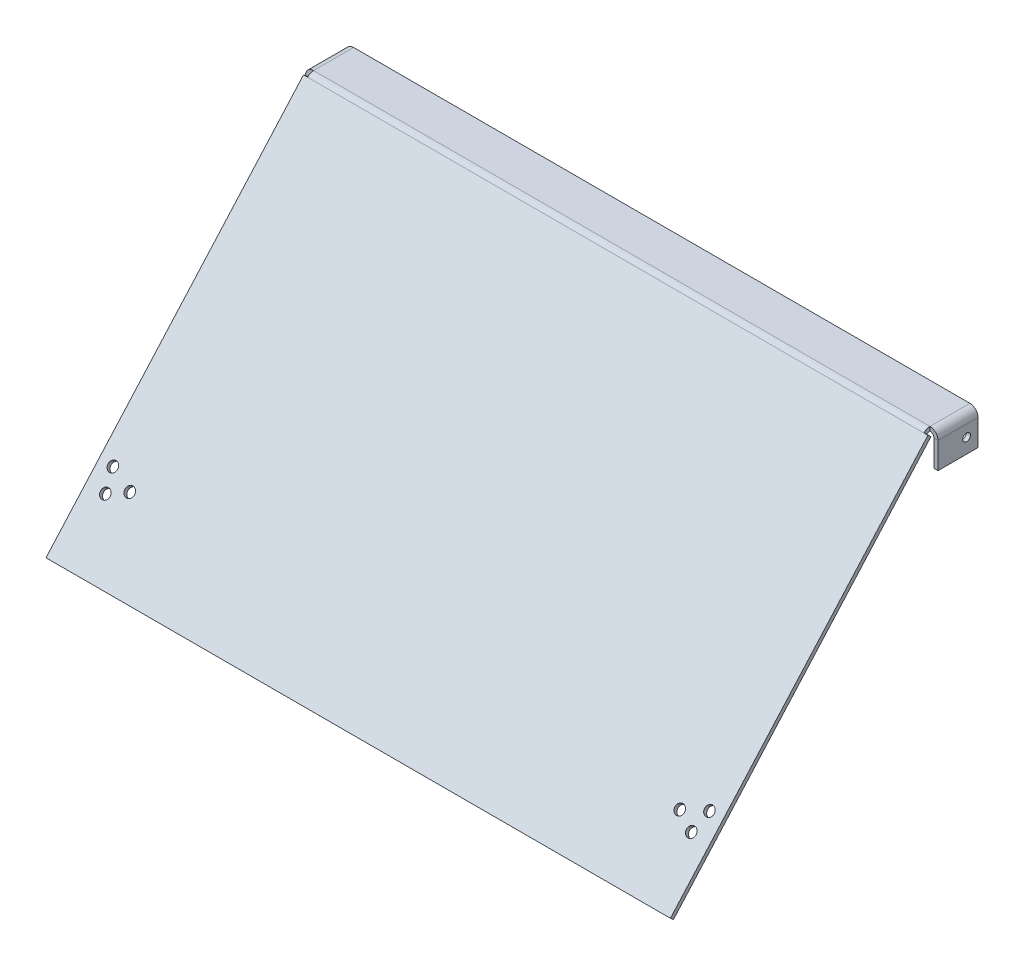
ISO-10303-21;
HEADER;
FILE_DESCRIPTION(('STEP AP214'),'2;1');
FILE_NAME('part.step','',(''),(''),'','','');
FILE_SCHEMA(('AUTOMOTIVE_DESIGN { 1 0 10303 214 1 1 1 1 }'));
ENDSEC;
DATA;
#1=APPLICATION_CONTEXT('core data for automotive mechanical design processes');
#2=APPLICATION_PROTOCOL_DEFINITION('international standard','automotive_design',2000,#1);
#3=PRODUCT_CONTEXT('',#1,'mechanical');
#4=PRODUCT('Part','Part','',(#3));
#5=PRODUCT_RELATED_PRODUCT_CATEGORY('part','',(#4));
#6=PRODUCT_DEFINITION_FORMATION('','',#4);
#7=PRODUCT_DEFINITION_CONTEXT('part definition',#1,'design');
#8=PRODUCT_DEFINITION('design','',#6,#7);
#9=PRODUCT_DEFINITION_SHAPE('','',#8);
#10=(LENGTH_UNIT() NAMED_UNIT(*) SI_UNIT(.MILLI.,.METRE.));
#11=(NAMED_UNIT(*) PLANE_ANGLE_UNIT() SI_UNIT($,.RADIAN.));
#12=(NAMED_UNIT(*) SI_UNIT($,.STERADIAN.) SOLID_ANGLE_UNIT());
#13=UNCERTAINTY_MEASURE_WITH_UNIT(LENGTH_MEASURE(1.E-05),#10,'distance_accuracy_value','');
#14=(GEOMETRIC_REPRESENTATION_CONTEXT(3) GLOBAL_UNCERTAINTY_ASSIGNED_CONTEXT((#13)) GLOBAL_UNIT_ASSIGNED_CONTEXT((#10,
#11,#12)) REPRESENTATION_CONTEXT('',''));
#15=CARTESIAN_POINT('',(0.,0.,0.));
#16=DIRECTION('',(0.,0.,1.));
#17=DIRECTION('',(1.,0.,0.));
#18=AXIS2_PLACEMENT_3D('',#15,#16,#17);
#19=CARTESIAN_POINT('',(0.,98.9907189973047,-88.0496395291812));
#20=DIRECTION('',(0.,0.747192308282182,-0.664607895261518));
#21=DIRECTION('',(0.,0.664607895261518,0.747192308282182));
#22=AXIS2_PLACEMENT_3D('',#19,#20,#21);
#23=PLANE('',#22);
#24=DIRECTION('',(0.,-0.664607895261518,-0.747192308282182));
#25=VECTOR('',#24,1.);
#26=CARTESIAN_POINT('',(202.70216,202.194058631598,27.9777837283082));
#27=LINE('',#26,#25);
#28=CARTESIAN_POINT('',(202.70216,202.194058631598,27.9777837283082));
#29=VERTEX_POINT('',#28);
#30=CARTESIAN_POINT('',(202.70216,200.428301791151,25.9926133159718));
#31=VERTEX_POINT('',#30);
#32=EDGE_CURVE('E12',#29,#31,#27,.T.);
#33=ORIENTED_EDGE('',*,*,#32,.F.);
#34=DIRECTION('',(-1.,0.,0.));
#35=VECTOR('',#34,1.);
#36=CARTESIAN_POINT('',(205.359,202.194058631598,27.9777837283082));
#37=LINE('',#36,#35);
#38=CARTESIAN_POINT('',(205.359,202.194058631598,27.9777837283082));
#39=VERTEX_POINT('',#38);
#40=EDGE_CURVE('E302',#39,#29,#37,.T.);
#41=ORIENTED_EDGE('',*,*,#40,.F.);
#42=DIRECTION('',(0.,0.664607895261518,0.747192308282182));
#43=VECTOR('',#42,1.);
#44=CARTESIAN_POINT('',(205.359,200.428301791151,25.9926133159718));
#45=LINE('',#44,#43);
#46=CARTESIAN_POINT('',(205.359,200.428301791151,25.9926133159718));
#47=VERTEX_POINT('',#46);
#48=EDGE_CURVE('E326',#47,#39,#45,.T.);
#49=ORIENTED_EDGE('',*,*,#48,.F.);
#50=DIRECTION('',(-1.,0.,0.));
#51=VECTOR('',#50,1.);
#52=CARTESIAN_POINT('',(205.359,200.428301791151,25.9926133159718));
#53=LINE('',#52,#51);
#54=EDGE_CURVE('E316',#47,#31,#53,.T.);
#55=ORIENTED_EDGE('',*,*,#54,.T.);
#56=EDGE_LOOP('',(#33,#41,#49,#55));
#57=FACE_BOUND('',#56,.T.);
#58=ADVANCED_FACE('F43',(#57),#23,.T.);
#59=CARTESIAN_POINT('',(205.359,198.662544950704,24.0074429036354));
#60=DIRECTION('',(-1.,0.,0.));
#61=DIRECTION('',(0.,0.,1.));
#62=AXIS2_PLACEMENT_3D('',#59,#60,#61);
#63=CYLINDRICAL_SURFACE('',#62,2.65684);
#64=DIRECTION('',(-1.,0.,0.));
#65=VECTOR('',#64,1.);
#66=CARTESIAN_POINT('',(205.359,201.319384950704,24.0074429036354));
#67=LINE('',#66,#65);
#68=CARTESIAN_POINT('',(202.70216,201.319384950704,24.0074429036354));
#69=VERTEX_POINT('',#68);
#70=CARTESIAN_POINT('',(-202.70216,201.319384950704,24.0074429036353));
#71=VERTEX_POINT('',#70);
#72=EDGE_CURVE('E313',#69,#71,#67,.T.);
#73=ORIENTED_EDGE('',*,*,#72,.F.);
#74=CARTESIAN_POINT('',(202.70216,198.662544950704,24.0074429036354));
#75=DIRECTION('',(1.,0.,0.));
#76=DIRECTION('',(0.,0.,-1.));
#77=AXIS2_PLACEMENT_3D('',#74,#75,#76);
#78=CIRCLE('',#77,2.65684);
#79=EDGE_CURVE('E51',#69,#31,#78,.T.);
#80=ORIENTED_EDGE('',*,*,#79,.T.);
#81=CARTESIAN_POINT('',(-202.70216,200.428301791151,25.9926133159718));
#82=VERTEX_POINT('',#81);
#83=EDGE_CURVE('E319',#31,#82,#53,.T.);
#84=ORIENTED_EDGE('',*,*,#83,.T.);
#85=CARTESIAN_POINT('',(-202.70216,198.662544950704,24.0074429036354));
#86=DIRECTION('',(-1.,0.,0.));
#87=DIRECTION('',(0.,0.,1.));
#88=AXIS2_PLACEMENT_3D('',#85,#86,#87);
#89=CIRCLE('',#88,2.65684);
#90=EDGE_CURVE('E328',#82,#71,#89,.T.);
#91=ORIENTED_EDGE('',*,*,#90,.T.);
#92=EDGE_LOOP('',(#73,#80,#84,#91));
#93=FACE_BOUND('',#92,.T.);
#94=ADVANCED_FACE('F416',(#93),#63,.F.);
#95=CARTESIAN_POINT('',(202.70216,198.662544950704,24.0074429036354));
#96=DIRECTION('',(1.,0.,0.));
#97=DIRECTION('',(0.,0.,-1.));
#98=AXIS2_PLACEMENT_3D('',#95,#96,#97);
#99=PLANE('',#98);
#100=CARTESIAN_POINT('',(202.70216,198.662544950704,24.0074429036354));
#101=DIRECTION('',(1.,0.,0.));
#102=DIRECTION('',(0.,0.,-1.));
#103=AXIS2_PLACEMENT_3D('',#100,#101,#102);
#104=CIRCLE('',#103,5.31368);
#105=CARTESIAN_POINT('',(202.70216,203.976224950704,24.0074429036353));
#106=VERTEX_POINT('',#105);
#107=EDGE_CURVE('E337',#106,#29,#104,.T.);
#108=ORIENTED_EDGE('',*,*,#107,.T.);
#109=ORIENTED_EDGE('',*,*,#32,.T.);
#110=ORIENTED_EDGE('',*,*,#79,.F.);
#111=DIRECTION('',(0.,1.,0.));
#112=VECTOR('',#111,1.);
#113=CARTESIAN_POINT('',(202.70216,201.319384950704,24.0074429036353));
#114=LINE('',#113,#112);
#115=EDGE_CURVE('E219',#69,#106,#114,.T.);
#116=ORIENTED_EDGE('',*,*,#115,.T.);
#117=EDGE_LOOP('',(#108,#109,#110,#116));
#118=FACE_BOUND('',#117,.T.);
#119=ADVANCED_FACE('F420',(#118),#99,.T.);
#120=CARTESIAN_POINT('',(205.359,201.319384950704,-2.31673739193725));
#121=DIRECTION('',(0.,-1.,0.));
#122=DIRECTION('',(0.,0.,-1.));
#123=AXIS2_PLACEMENT_3D('',#120,#121,#122);
#124=PLANE('',#123);
#125=DIRECTION('',(-1.,0.,0.));
#126=VECTOR('',#125,1.);
#127=CARTESIAN_POINT('',(205.359,201.319384950704,-2.31673739193725));
#128=LINE('',#127,#126);
#129=CARTESIAN_POINT('',(202.70216,201.319384950704,-2.31673739193725));
#130=VERTEX_POINT('',#129);
#131=CARTESIAN_POINT('',(-202.70216,201.319384950704,-2.31673739193724));
#132=VERTEX_POINT('',#131);
#133=EDGE_CURVE('E311',#130,#132,#128,.T.);
#134=ORIENTED_EDGE('',*,*,#133,.F.);
#135=DIRECTION('',(0.,0.,1.));
#136=VECTOR('',#135,1.);
#137=CARTESIAN_POINT('',(202.70216,201.319384950704,24.0074429036353));
#138=LINE('',#137,#136);
#139=EDGE_CURVE('E223',#69,#130,#138,.F.);
#140=ORIENTED_EDGE('',*,*,#139,.F.);
#141=ORIENTED_EDGE('',*,*,#72,.T.);
#142=DIRECTION('',(0.,0.,-1.));
#143=VECTOR('',#142,1.);
#144=CARTESIAN_POINT('',(-202.70216,201.319384950704,-2.31673739193724));
#145=LINE('',#144,#143);
#146=EDGE_CURVE('E275',#132,#71,#145,.F.);
#147=ORIENTED_EDGE('',*,*,#146,.F.);
#148=EDGE_LOOP('',(#134,#140,#141,#147));
#149=FACE_BOUND('',#148,.T.);
#150=ADVANCED_FACE('F426',(#149),#124,.T.);
#151=CARTESIAN_POINT('',(205.359,203.976224950704,-2.31673739193725));
#152=DIRECTION('',(0.,-1.,0.));
#153=DIRECTION('',(0.,0.,-1.));
#154=AXIS2_PLACEMENT_3D('',#151,#152,#153);
#155=PLANE('',#154);
#156=DIRECTION('',(0.,0.,1.));
#157=VECTOR('',#156,1.);
#158=CARTESIAN_POINT('',(202.70216,203.976224950704,24.0074429036353));
#159=LINE('',#158,#157);
#160=CARTESIAN_POINT('',(202.70216,203.976224950704,-2.31673739193725));
#161=VERTEX_POINT('',#160);
#162=EDGE_CURVE('E173',#106,#161,#159,.F.);
#163=ORIENTED_EDGE('',*,*,#162,.T.);
#164=DIRECTION('',(-1.,0.,0.));
#165=VECTOR('',#164,1.);
#166=CARTESIAN_POINT('',(205.359,203.976224950704,-2.31673739193725));
#167=LINE('',#166,#165);
#168=CARTESIAN_POINT('',(-202.70216,203.976224950704,-2.31673739193724));
#169=VERTEX_POINT('',#168);
#170=EDGE_CURVE('E308',#161,#169,#167,.T.);
#171=ORIENTED_EDGE('',*,*,#170,.T.);
#172=DIRECTION('',(0.,0.,-1.));
#173=VECTOR('',#172,1.);
#174=CARTESIAN_POINT('',(-202.70216,203.976224950704,-2.31673739193724));
#175=LINE('',#174,#173);
#176=CARTESIAN_POINT('',(-202.70216,203.976224950704,24.0074429036353));
#177=VERTEX_POINT('',#176);
#178=EDGE_CURVE('E262',#169,#177,#175,.F.);
#179=ORIENTED_EDGE('',*,*,#178,.T.);
#180=DIRECTION('',(-1.,0.,0.));
#181=VECTOR('',#180,1.);
#182=CARTESIAN_POINT('',(205.359,203.976224950704,24.0074429036353));
#183=LINE('',#182,#181);
#184=EDGE_CURVE('E305',#106,#177,#183,.T.);
#185=ORIENTED_EDGE('',*,*,#184,.F.);
#186=EDGE_LOOP('',(#163,#171,#179,#185));
#187=FACE_BOUND('',#186,.T.);
#188=ADVANCED_FACE('F454',(#187),#155,.F.);
#189=CARTESIAN_POINT('',(0.,98.9907189973046,-88.0496395291812));
#190=DIRECTION('',(0.,-0.747192308282182,0.664607895261518));
#191=DIRECTION('',(0.,-0.664607895261518,-0.747192308282182));
#192=AXIS2_PLACEMENT_3D('',#189,#190,#191);
#193=PLANE('',#192);
#194=DIRECTION('',(0.,0.664607895261518,0.747192308282182));
#195=VECTOR('',#194,1.);
#196=CARTESIAN_POINT('',(-202.70216,200.428301791151,25.9926133159718));
#197=LINE('',#196,#195);
#198=CARTESIAN_POINT('',(-202.70216,202.194058631598,27.9777837283082));
#199=VERTEX_POINT('',#198);
#200=EDGE_CURVE('E334',#82,#199,#197,.T.);
#201=ORIENTED_EDGE('',*,*,#200,.F.);
#202=CARTESIAN_POINT('',(-205.359,200.428301791151,25.9926133159718));
#203=VERTEX_POINT('',#202);
#204=EDGE_CURVE('E315',#82,#203,#53,.T.);
#205=ORIENTED_EDGE('',*,*,#204,.T.);
#206=DIRECTION('',(0.,-0.664607895261518,-0.747192308282182));
#207=VECTOR('',#206,1.);
#208=CARTESIAN_POINT('',(-205.359,202.194058631598,27.9777837283082));
#209=LINE('',#208,#207);
#210=CARTESIAN_POINT('',(-205.359,202.194058631598,27.9777837283082));
#211=VERTEX_POINT('',#210);
#212=EDGE_CURVE('E323',#211,#203,#209,.T.);
#213=ORIENTED_EDGE('',*,*,#212,.F.);
#214=EDGE_CURVE('E294',#199,#211,#37,.T.);
#215=ORIENTED_EDGE('',*,*,#214,.F.);
#216=EDGE_LOOP('',(#201,#205,#213,#215));
#217=FACE_BOUND('',#216,.T.);
#218=ADVANCED_FACE('F452',(#217),#193,.F.);
#219=CARTESIAN_POINT('',(205.359,203.976224950704,-2.31673739193725));
#220=DIRECTION('',(0.,0.,-1.));
#221=DIRECTION('',(-1.,0.,0.));
#222=AXIS2_PLACEMENT_3D('',#219,#220,#221);
#223=PLANE('',#222);
#224=DIRECTION('',(0.,1.,0.));
#225=VECTOR('',#224,1.);
#226=CARTESIAN_POINT('',(202.70216,201.319384950704,-2.31673739193724));
#227=LINE('',#226,#225);
#228=EDGE_CURVE('E227',#130,#161,#227,.T.);
#229=ORIENTED_EDGE('',*,*,#228,.F.);
#230=ORIENTED_EDGE('',*,*,#133,.T.);
#231=DIRECTION('',(0.,1.,0.));
#232=VECTOR('',#231,1.);
#233=CARTESIAN_POINT('',(-202.70216,201.319384950704,-2.31673739193724));
#234=LINE('',#233,#232);
#235=EDGE_CURVE('E269',#132,#169,#234,.T.);
#236=ORIENTED_EDGE('',*,*,#235,.T.);
#237=ORIENTED_EDGE('',*,*,#170,.F.);
#238=EDGE_LOOP('',(#229,#230,#236,#237));
#239=FACE_BOUND('',#238,.T.);
#240=ADVANCED_FACE('F446',(#239),#223,.T.);
#241=CARTESIAN_POINT('',(205.359,203.976224950704,24.0074429036353));
#242=DIRECTION('',(1.,0.,0.));
#243=DIRECTION('',(0.,0.,-1.));
#244=AXIS2_PLACEMENT_3D('',#241,#242,#243);
#245=PLANE('',#244);
#246=DIRECTION('',(0.,-0.747192308282181,0.664607895261519));
#247=VECTOR('',#246,1.);
#248=CARTESIAN_POINT('',(205.359,201.319384950704,25.2000182951059));
#249=LINE('',#248,#247);
#250=CARTESIAN_POINT('',(205.359,10.014243876601,195.360906934703));
#251=VERTEX_POINT('',#250);
#252=EDGE_CURVE('E291',#47,#251,#249,.T.);
#253=ORIENTED_EDGE('',*,*,#252,.F.);
#254=ORIENTED_EDGE('',*,*,#48,.T.);
#255=DIRECTION('',(0.,-0.747192308282181,0.664607895261519));
#256=VECTOR('',#255,1.);
#257=CARTESIAN_POINT('',(205.359,203.085141791151,27.1851887074423));
#258=LINE('',#257,#256);
#259=CARTESIAN_POINT('',(205.359,11.7800007170476,197.346077347039));
#260=VERTEX_POINT('',#259);
#261=EDGE_CURVE('E285',#39,#260,#258,.T.);
#262=ORIENTED_EDGE('',*,*,#261,.T.);
#263=DIRECTION('',(0.,0.664607895261532,0.747192308282169));
#264=VECTOR('',#263,1.);
#265=CARTESIAN_POINT('',(205.359,10.014243876601,195.360906934703));
#266=LINE('',#265,#264);
#267=EDGE_CURVE('E287',#251,#260,#266,.T.);
#268=ORIENTED_EDGE('',*,*,#267,.F.);
#269=EDGE_LOOP('',(#253,#254,#262,#268));
#270=FACE_BOUND('',#269,.T.);
#271=ADVANCED_FACE('F442',(#270),#245,.T.);
#272=CARTESIAN_POINT('',(205.359,203.085141791151,27.1851887074423));
#273=DIRECTION('',(0.,-0.664607895261519,-0.747192308282181));
#274=DIRECTION('',(0.,0.747192308282181,-0.664607895261519));
#275=AXIS2_PLACEMENT_3D('',#272,#273,#274);
#276=PLANE('',#275);
#277=CARTESIAN_POINT('',(180.893128060702,46.1870021263397,166.74195504088));
#278=DIRECTION('',(0.,-0.664607895261519,-0.747192308282181));
#279=DIRECTION('',(0.,-0.747192308282181,0.664607895261519));
#280=AXIS2_PLACEMENT_3D('',#277,#278,#279);
#281=CIRCLE('',#280,3.17500000003915);
#282=CARTESIAN_POINT('',(180.893128060702,43.8146665475145,168.852085108361));
#283=VERTEX_POINT('',#282);
#284=EDGE_CURVE('E359',#283,#283,#281,.T.);
#285=ORIENTED_EDGE('',*,*,#284,.T.);
#286=EDGE_LOOP('',(#285));
#287=FACE_BOUND('',#286,.T.);
#288=CARTESIAN_POINT('',(196.215000000167,50.9316732839315,162.521694905969));
#289=DIRECTION('',(0.,-0.664607895261519,-0.747192308282181));
#290=DIRECTION('',(0.,-0.747192308282181,0.664607895261519));
#291=AXIS2_PLACEMENT_3D('',#288,#289,#290);
#292=CIRCLE('',#291,3.17500000003912);
#293=CARTESIAN_POINT('',(196.215000000167,48.5593377051064,164.63182497345));
#294=VERTEX_POINT('',#293);
#295=EDGE_CURVE('E714',#294,#294,#292,.T.);
#296=ORIENTED_EDGE('',*,*,#295,.T.);
#297=EDGE_LOOP('',(#296));
#298=FACE_BOUND('',#297,.T.);
#299=CARTESIAN_POINT('',(192.704128060702,41.4423309687478,170.96221517579));
#300=DIRECTION('',(0.,-0.664607895261519,-0.747192308282181));
#301=DIRECTION('',(0.,-0.747192308282181,0.664607895261519));
#302=AXIS2_PLACEMENT_3D('',#299,#300,#301);
#303=CIRCLE('',#302,3.17500000003913);
#304=CARTESIAN_POINT('',(192.704128060702,39.0699953899227,173.072345243272));
#305=VERTEX_POINT('',#304);
#306=EDGE_CURVE('E711',#305,#305,#303,.T.);
#307=ORIENTED_EDGE('',*,*,#306,.T.);
#308=EDGE_LOOP('',(#307));
#309=FACE_BOUND('',#308,.T.);
#310=CARTESIAN_POINT('',(-180.893128060702,46.1870021263397,166.74195504088));
#311=DIRECTION('',(0.,0.664607895261519,0.747192308282181));
#312=DIRECTION('',(0.,-0.747192308282181,0.664607895261519));
#313=AXIS2_PLACEMENT_3D('',#310,#311,#312);
#314=CIRCLE('',#313,3.17500000003915);
#315=CARTESIAN_POINT('',(-180.893128060702,43.8146665475145,168.852085108361));
#316=VERTEX_POINT('',#315);
#317=EDGE_CURVE('E349',#316,#316,#314,.T.);
#318=ORIENTED_EDGE('',*,*,#317,.F.);
#319=EDGE_LOOP('',(#318));
#320=FACE_BOUND('',#319,.T.);
#321=CARTESIAN_POINT('',(-196.215000000167,50.9316732839315,162.521694905969));
#322=DIRECTION('',(0.,0.664607895261519,0.747192308282181));
#323=DIRECTION('',(0.,-0.747192308282181,0.664607895261519));
#324=AXIS2_PLACEMENT_3D('',#321,#322,#323);
#325=CIRCLE('',#324,3.17500000003912);
#326=CARTESIAN_POINT('',(-196.215000000167,48.5593377051064,164.63182497345));
#327=VERTEX_POINT('',#326);
#328=EDGE_CURVE('E364',#327,#327,#325,.T.);
#329=ORIENTED_EDGE('',*,*,#328,.F.);
#330=EDGE_LOOP('',(#329));
#331=FACE_BOUND('',#330,.T.);
#332=CARTESIAN_POINT('',(-192.704128060702,41.4423309687478,170.96221517579));
#333=DIRECTION('',(0.,0.664607895261519,0.747192308282181));
#334=DIRECTION('',(0.,-0.747192308282181,0.664607895261519));
#335=AXIS2_PLACEMENT_3D('',#332,#333,#334);
#336=CIRCLE('',#335,3.17500000003913);
#337=CARTESIAN_POINT('',(-192.704128060702,39.0699953899227,173.072345243272));
#338=VERTEX_POINT('',#337);
#339=EDGE_CURVE('E368',#338,#338,#336,.T.);
#340=ORIENTED_EDGE('',*,*,#339,.F.);
#341=EDGE_LOOP('',(#340));
#342=FACE_BOUND('',#341,.T.);
#343=DIRECTION('',(0.,-0.747192308282181,0.664607895261519));
#344=VECTOR('',#343,1.);
#345=CARTESIAN_POINT('',(-205.359,203.085141791151,27.1851887074423));
#346=LINE('',#345,#344);
#347=CARTESIAN_POINT('',(-205.359,11.7800007170476,197.346077347039));
#348=VERTEX_POINT('',#347);
#349=EDGE_CURVE('E283',#211,#348,#346,.T.);
#350=ORIENTED_EDGE('',*,*,#349,.T.);
#351=DIRECTION('',(-1.,0.,0.));
#352=VECTOR('',#351,1.);
#353=CARTESIAN_POINT('',(205.359,11.7800007170476,197.346077347039));
#354=LINE('',#353,#352);
#355=EDGE_CURVE('E321',#260,#348,#354,.T.);
#356=ORIENTED_EDGE('',*,*,#355,.F.);
#357=ORIENTED_EDGE('',*,*,#261,.F.);
#358=ORIENTED_EDGE('',*,*,#40,.T.);
#359=EDGE_CURVE('E306',#29,#199,#37,.T.);
#360=ORIENTED_EDGE('',*,*,#359,.T.);
#361=ORIENTED_EDGE('',*,*,#214,.T.);
#362=EDGE_LOOP('',(#350,#356,#357,#358,#360,#361));
#363=FACE_BOUND('',#362,.T.);
#364=ADVANCED_FACE('F438',(#287,#298,#309,#320,#331,#342,#363),#276,.F.);
#365=CARTESIAN_POINT('',(205.359,10.014243876601,195.360906934703));
#366=DIRECTION('',(0.,-0.747192308282169,0.664607895261532));
#367=DIRECTION('',(0.,-0.664607895261532,-0.747192308282169));
#368=AXIS2_PLACEMENT_3D('',#365,#366,#367);
#369=PLANE('',#368);
#370=DIRECTION('',(0.,0.664607895261532,0.747192308282169));
#371=VECTOR('',#370,1.);
#372=CARTESIAN_POINT('',(-205.359,10.014243876601,195.360906934703));
#373=LINE('',#372,#371);
#374=CARTESIAN_POINT('',(-205.359,10.014243876601,195.360906934703));
#375=VERTEX_POINT('',#374);
#376=EDGE_CURVE('E297',#375,#348,#373,.T.);
#377=ORIENTED_EDGE('',*,*,#376,.F.);
#378=DIRECTION('',(-1.,0.,0.));
#379=VECTOR('',#378,1.);
#380=CARTESIAN_POINT('',(205.359,10.014243876601,195.360906934703));
#381=LINE('',#380,#379);
#382=EDGE_CURVE('E318',#251,#375,#381,.T.);
#383=ORIENTED_EDGE('',*,*,#382,.F.);
#384=ORIENTED_EDGE('',*,*,#267,.T.);
#385=ORIENTED_EDGE('',*,*,#355,.T.);
#386=EDGE_LOOP('',(#377,#383,#384,#385));
#387=FACE_BOUND('',#386,.T.);
#388=ADVANCED_FACE('F435',(#387),#369,.T.);
#389=CARTESIAN_POINT('',(205.359,201.319384950704,25.2000182951059));
#390=DIRECTION('',(0.,-0.664607895261519,-0.747192308282181));
#391=DIRECTION('',(0.,0.747192308282181,-0.664607895261519));
#392=AXIS2_PLACEMENT_3D('',#389,#390,#391);
#393=PLANE('',#392);
#394=CARTESIAN_POINT('',(180.893128060702,44.4212452858931,164.756784628543));
#395=DIRECTION('',(0.,-0.664607895261519,-0.747192308282181));
#396=DIRECTION('',(0.,0.747192308282181,-0.664607895261519));
#397=AXIS2_PLACEMENT_3D('',#394,#395,#396);
#398=CIRCLE('',#397,3.17500000003915);
#399=CARTESIAN_POINT('',(180.893128060702,46.7935808647183,162.646654561062));
#400=VERTEX_POINT('',#399);
#401=EDGE_CURVE('E46',#400,#400,#398,.F.);
#402=ORIENTED_EDGE('',*,*,#401,.T.);
#403=EDGE_LOOP('',(#402));
#404=FACE_BOUND('',#403,.T.);
#405=CARTESIAN_POINT('',(196.215000000167,49.1659164434849,160.536524493633));
#406=DIRECTION('',(0.,-0.664607895261519,-0.747192308282181));
#407=DIRECTION('',(0.,0.747192308282181,-0.664607895261519));
#408=AXIS2_PLACEMENT_3D('',#405,#406,#407);
#409=CIRCLE('',#408,3.17500000003912);
#410=CARTESIAN_POINT('',(196.215000000167,51.5382520223101,158.426394426151));
#411=VERTEX_POINT('',#410);
#412=EDGE_CURVE('E358',#411,#411,#409,.F.);
#413=ORIENTED_EDGE('',*,*,#412,.T.);
#414=EDGE_LOOP('',(#413));
#415=FACE_BOUND('',#414,.T.);
#416=CARTESIAN_POINT('',(192.704128060702,39.6765741283012,168.977044763454));
#417=DIRECTION('',(0.,-0.664607895261519,-0.747192308282181));
#418=DIRECTION('',(0.,0.747192308282181,-0.664607895261519));
#419=AXIS2_PLACEMENT_3D('',#416,#417,#418);
#420=CIRCLE('',#419,3.17500000003913);
#421=CARTESIAN_POINT('',(192.704128060702,42.0489097071264,166.866914695973));
#422=VERTEX_POINT('',#421);
#423=EDGE_CURVE('E356',#422,#422,#420,.F.);
#424=ORIENTED_EDGE('',*,*,#423,.T.);
#425=EDGE_LOOP('',(#424));
#426=FACE_BOUND('',#425,.T.);
#427=CARTESIAN_POINT('',(-180.893128060702,44.4212452858931,164.756784628543));
#428=DIRECTION('',(0.,-0.664607895261519,-0.747192308282181));
#429=DIRECTION('',(0.,0.747192308282181,-0.664607895261519));
#430=AXIS2_PLACEMENT_3D('',#427,#428,#429);
#431=CIRCLE('',#430,3.17500000003915);
#432=CARTESIAN_POINT('',(-180.893128060702,46.7935808647183,162.646654561062));
#433=VERTEX_POINT('',#432);
#434=EDGE_CURVE('E352',#433,#433,#431,.T.);
#435=ORIENTED_EDGE('',*,*,#434,.F.);
#436=EDGE_LOOP('',(#435));
#437=FACE_BOUND('',#436,.T.);
#438=CARTESIAN_POINT('',(-196.215000000167,49.1659164434849,160.536524493633));
#439=DIRECTION('',(0.,-0.664607895261519,-0.747192308282181));
#440=DIRECTION('',(0.,0.747192308282181,-0.664607895261519));
#441=AXIS2_PLACEMENT_3D('',#438,#439,#440);
#442=CIRCLE('',#441,3.17500000003912);
#443=CARTESIAN_POINT('',(-196.215000000167,51.5382520223101,158.426394426151));
#444=VERTEX_POINT('',#443);
#445=EDGE_CURVE('E348',#444,#444,#442,.T.);
#446=ORIENTED_EDGE('',*,*,#445,.F.);
#447=EDGE_LOOP('',(#446));
#448=FACE_BOUND('',#447,.T.);
#449=CARTESIAN_POINT('',(-192.704128060702,39.6765741283012,168.977044763454));
#450=DIRECTION('',(0.,-0.664607895261519,-0.747192308282181));
#451=DIRECTION('',(0.,0.747192308282181,-0.664607895261519));
#452=AXIS2_PLACEMENT_3D('',#449,#450,#451);
#453=CIRCLE('',#452,3.17500000003913);
#454=CARTESIAN_POINT('',(-192.704128060702,42.0489097071264,166.866914695973));
#455=VERTEX_POINT('',#454);
#456=EDGE_CURVE('E345',#455,#455,#453,.T.);
#457=ORIENTED_EDGE('',*,*,#456,.F.);
#458=EDGE_LOOP('',(#457));
#459=FACE_BOUND('',#458,.T.);
#460=DIRECTION('',(0.,-0.747192308282181,0.664607895261519));
#461=VECTOR('',#460,1.);
#462=CARTESIAN_POINT('',(-205.359,201.319384950704,25.2000182951059));
#463=LINE('',#462,#461);
#464=EDGE_CURVE('E288',#203,#375,#463,.T.);
#465=ORIENTED_EDGE('',*,*,#464,.F.);
#466=ORIENTED_EDGE('',*,*,#204,.F.);
#467=ORIENTED_EDGE('',*,*,#83,.F.);
#468=ORIENTED_EDGE('',*,*,#54,.F.);
#469=ORIENTED_EDGE('',*,*,#252,.T.);
#470=ORIENTED_EDGE('',*,*,#382,.T.);
#471=EDGE_LOOP('',(#465,#466,#467,#468,#469,#470));
#472=FACE_BOUND('',#471,.T.);
#473=ADVANCED_FACE('F431',(#404,#415,#426,#437,#448,#459,#472),#393,.T.);
#474=CARTESIAN_POINT('',(-202.70216,198.662544950704,24.0074429036354));
#475=DIRECTION('',(-1.,0.,0.));
#476=DIRECTION('',(0.,0.,1.));
#477=AXIS2_PLACEMENT_3D('',#474,#475,#476);
#478=PLANE('',#477);
#479=ORIENTED_EDGE('',*,*,#90,.F.);
#480=ORIENTED_EDGE('',*,*,#200,.T.);
#481=CARTESIAN_POINT('',(-202.70216,198.662544950704,24.0074429036354));
#482=DIRECTION('',(-1.,0.,0.));
#483=DIRECTION('',(0.,0.,1.));
#484=AXIS2_PLACEMENT_3D('',#481,#482,#483);
#485=CIRCLE('',#484,5.31368);
#486=EDGE_CURVE('E331',#199,#177,#485,.T.);
#487=ORIENTED_EDGE('',*,*,#486,.T.);
#488=DIRECTION('',(0.,1.,0.));
#489=VECTOR('',#488,1.);
#490=CARTESIAN_POINT('',(-202.70216,201.319384950704,24.0074429036353));
#491=LINE('',#490,#489);
#492=EDGE_CURVE('E280',#71,#177,#491,.T.);
#493=ORIENTED_EDGE('',*,*,#492,.F.);
#494=EDGE_LOOP('',(#479,#480,#487,#493));
#495=FACE_BOUND('',#494,.T.);
#496=ADVANCED_FACE('F434',(#495),#478,.T.);
#497=CARTESIAN_POINT('',(205.359,198.662544950704,24.0074429036354));
#498=DIRECTION('',(-1.,0.,0.));
#499=DIRECTION('',(0.,0.,1.));
#500=AXIS2_PLACEMENT_3D('',#497,#498,#499);
#501=CYLINDRICAL_SURFACE('',#500,5.31368);
#502=ORIENTED_EDGE('',*,*,#107,.F.);
#503=ORIENTED_EDGE('',*,*,#184,.T.);
#504=ORIENTED_EDGE('',*,*,#486,.F.);
#505=ORIENTED_EDGE('',*,*,#359,.F.);
#506=EDGE_LOOP('',(#502,#503,#504,#505));
#507=FACE_BOUND('',#506,.T.);
#508=ADVANCED_FACE('F450',(#507),#501,.T.);
#509=CARTESIAN_POINT('',(-205.359,198.662544950704,24.0074429036354));
#510=DIRECTION('',(-1.,0.,0.));
#511=DIRECTION('',(0.,0.,1.));
#512=AXIS2_PLACEMENT_3D('',#509,#510,#511);
#513=PLANE('',#512);
#514=ORIENTED_EDGE('',*,*,#349,.F.);
#515=ORIENTED_EDGE('',*,*,#212,.T.);
#516=ORIENTED_EDGE('',*,*,#464,.T.);
#517=ORIENTED_EDGE('',*,*,#376,.T.);
#518=EDGE_LOOP('',(#514,#515,#516,#517));
#519=FACE_BOUND('',#518,.T.);
#520=ADVANCED_FACE('F536',(#519),#513,.T.);
#521=CARTESIAN_POINT('',(-202.70216,198.662544950704,24.0074429036353));
#522=DIRECTION('',(0.,0.,1.));
#523=DIRECTION('',(1.,0.,0.));
#524=AXIS2_PLACEMENT_3D('',#521,#522,#523);
#525=PLANE('',#524);
#526=DIRECTION('',(-1.,0.,0.));
#527=VECTOR('',#526,1.);
#528=CARTESIAN_POINT('',(-205.359,198.662544950704,24.0074429036354));
#529=LINE('',#528,#527);
#530=CARTESIAN_POINT('',(-205.359,198.662544950704,24.0074429036353));
#531=VERTEX_POINT('',#530);
#532=CARTESIAN_POINT('',(-208.01584,198.662544950704,24.0074429036353));
#533=VERTEX_POINT('',#532);
#534=EDGE_CURVE('E230',#531,#533,#529,.T.);
#535=ORIENTED_EDGE('',*,*,#534,.F.);
#536=CARTESIAN_POINT('',(-202.70216,198.662544950704,24.0074429036353));
#537=DIRECTION('',(0.,0.,-1.));
#538=DIRECTION('',(-1.,0.,0.));
#539=AXIS2_PLACEMENT_3D('',#536,#537,#538);
#540=CIRCLE('',#539,2.65683999999999);
#541=EDGE_CURVE('E272',#71,#531,#540,.F.);
#542=ORIENTED_EDGE('',*,*,#541,.F.);
#543=ORIENTED_EDGE('',*,*,#492,.T.);
#544=CARTESIAN_POINT('',(-202.70216,198.662544950704,24.0074429036353));
#545=DIRECTION('',(0.,0.,-1.));
#546=DIRECTION('',(-1.,0.,0.));
#547=AXIS2_PLACEMENT_3D('',#544,#545,#546);
#548=CIRCLE('',#547,5.31367999999999);
#549=EDGE_CURVE('E265',#177,#533,#548,.F.);
#550=ORIENTED_EDGE('',*,*,#549,.T.);
#551=EDGE_LOOP('',(#535,#542,#543,#550));
#552=FACE_BOUND('',#551,.T.);
#553=ADVANCED_FACE('F507',(#552),#525,.T.);
#554=CARTESIAN_POINT('',(-202.70216,198.662544950704,-2.31673739193724));
#555=DIRECTION('',(0.,0.,1.));
#556=DIRECTION('',(1.,0.,0.));
#557=AXIS2_PLACEMENT_3D('',#554,#555,#556);
#558=PLANE('',#557);
#559=CARTESIAN_POINT('',(-202.70216,198.662544950704,-2.31673739193724));
#560=DIRECTION('',(0.,0.,-1.));
#561=DIRECTION('',(-1.,0.,0.));
#562=AXIS2_PLACEMENT_3D('',#559,#560,#561);
#563=CIRCLE('',#562,2.65683999999999);
#564=CARTESIAN_POINT('',(-205.359,198.662544950704,-2.31673739193724));
#565=VERTEX_POINT('',#564);
#566=EDGE_CURVE('E261',#565,#132,#563,.T.);
#567=ORIENTED_EDGE('',*,*,#566,.F.);
#568=DIRECTION('',(-1.,0.,0.));
#569=VECTOR('',#568,1.);
#570=CARTESIAN_POINT('',(-205.359,198.662544950704,-2.31673739193724));
#571=LINE('',#570,#569);
#572=CARTESIAN_POINT('',(-208.01584,198.662544950704,-2.31673739193724));
#573=VERTEX_POINT('',#572);
#574=EDGE_CURVE('E234',#565,#573,#571,.T.);
#575=ORIENTED_EDGE('',*,*,#574,.T.);
#576=CARTESIAN_POINT('',(-202.70216,198.662544950704,-2.31673739193724));
#577=DIRECTION('',(0.,0.,-1.));
#578=DIRECTION('',(-1.,0.,0.));
#579=AXIS2_PLACEMENT_3D('',#576,#577,#578);
#580=CIRCLE('',#579,5.31367999999999);
#581=EDGE_CURVE('E266',#573,#169,#580,.T.);
#582=ORIENTED_EDGE('',*,*,#581,.T.);
#583=ORIENTED_EDGE('',*,*,#235,.F.);
#584=EDGE_LOOP('',(#567,#575,#582,#583));
#585=FACE_BOUND('',#584,.T.);
#586=ADVANCED_FACE('F486',(#585),#558,.F.);
#587=CARTESIAN_POINT('',(-202.70216,198.662544950704,-2.31673739193724));
#588=DIRECTION('',(0.,0.,-1.));
#589=DIRECTION('',(-1.,0.,0.));
#590=AXIS2_PLACEMENT_3D('',#587,#588,#589);
#591=CYLINDRICAL_SURFACE('',#590,5.31367999999999);
#592=ORIENTED_EDGE('',*,*,#178,.F.);
#593=ORIENTED_EDGE('',*,*,#581,.F.);
#594=DIRECTION('',(0.,0.,1.));
#595=VECTOR('',#594,1.);
#596=CARTESIAN_POINT('',(-208.01584,198.662544950704,0.));
#597=LINE('',#596,#595);
#598=EDGE_CURVE('E237',#573,#533,#597,.T.);
#599=ORIENTED_EDGE('',*,*,#598,.T.);
#600=ORIENTED_EDGE('',*,*,#549,.F.);
#601=EDGE_LOOP('',(#592,#593,#599,#600));
#602=FACE_BOUND('',#601,.T.);
#603=ADVANCED_FACE('F483',(#602),#591,.T.);
#604=CARTESIAN_POINT('',(-202.70216,198.662544950704,-2.31673739193724));
#605=DIRECTION('',(0.,0.,-1.));
#606=DIRECTION('',(-1.,0.,0.));
#607=AXIS2_PLACEMENT_3D('',#604,#605,#606);
#608=CYLINDRICAL_SURFACE('',#607,2.65683999999999);
#609=ORIENTED_EDGE('',*,*,#146,.T.);
#610=ORIENTED_EDGE('',*,*,#541,.T.);
#611=DIRECTION('',(0.,0.,-1.));
#612=VECTOR('',#611,1.);
#613=CARTESIAN_POINT('',(-205.359,198.662544950704,24.0074429036354));
#614=LINE('',#613,#612);
#615=EDGE_CURVE('E232',#531,#565,#614,.T.);
#616=ORIENTED_EDGE('',*,*,#615,.T.);
#617=ORIENTED_EDGE('',*,*,#566,.T.);
#618=EDGE_LOOP('',(#609,#610,#616,#617));
#619=FACE_BOUND('',#618,.T.);
#620=ADVANCED_FACE('F510',(#619),#608,.F.);
#621=CARTESIAN_POINT('',(-208.01584,181.399384950704,-2.31673739193724));
#622=DIRECTION('',(0.,0.,1.));
#623=DIRECTION('',(0.,-1.,0.));
#624=AXIS2_PLACEMENT_3D('',#621,#622,#623);
#625=PLANE('',#624);
#626=ORIENTED_EDGE('',*,*,#574,.F.);
#627=DIRECTION('',(0.,-1.,0.));
#628=VECTOR('',#627,1.);
#629=CARTESIAN_POINT('',(-205.359,181.399384950704,-2.31673739193724));
#630=LINE('',#629,#628);
#631=CARTESIAN_POINT('',(-205.359,181.399384950704,-2.31673739193724));
#632=VERTEX_POINT('',#631);
#633=EDGE_CURVE('E241',#565,#632,#630,.T.);
#634=ORIENTED_EDGE('',*,*,#633,.T.);
#635=DIRECTION('',(1.,0.,0.));
#636=VECTOR('',#635,1.);
#637=CARTESIAN_POINT('',(-208.01584,181.399384950704,-2.31673739193724));
#638=LINE('',#637,#636);
#639=CARTESIAN_POINT('',(-208.01584,181.399384950704,-2.31673739193724));
#640=VERTEX_POINT('',#639);
#641=EDGE_CURVE('E258',#640,#632,#638,.T.);
#642=ORIENTED_EDGE('',*,*,#641,.F.);
#643=DIRECTION('',(0.,-1.,0.));
#644=VECTOR('',#643,1.);
#645=CARTESIAN_POINT('',(-208.01584,181.399384950704,-2.31673739193724));
#646=LINE('',#645,#644);
#647=EDGE_CURVE('E242',#573,#640,#646,.T.);
#648=ORIENTED_EDGE('',*,*,#647,.F.);
#649=EDGE_LOOP('',(#626,#634,#642,#648));
#650=FACE_BOUND('',#649,.T.);
#651=ADVANCED_FACE('F497',(#650),#625,.F.);
#652=CARTESIAN_POINT('',(-208.01584,201.319384950704,24.0074429036354));
#653=DIRECTION('',(0.,0.,-1.));
#654=DIRECTION('',(-1.,0.,0.));
#655=AXIS2_PLACEMENT_3D('',#652,#653,#654);
#656=PLANE('',#655);
#657=ORIENTED_EDGE('',*,*,#534,.T.);
#658=DIRECTION('',(0.,1.,0.));
#659=VECTOR('',#658,1.);
#660=CARTESIAN_POINT('',(-208.01584,201.319384950704,24.0074429036354));
#661=LINE('',#660,#659);
#662=CARTESIAN_POINT('',(-208.01584,181.399384950704,24.0074429036354));
#663=VERTEX_POINT('',#662);
#664=EDGE_CURVE('E247',#663,#533,#661,.T.);
#665=ORIENTED_EDGE('',*,*,#664,.F.);
#666=DIRECTION('',(1.,0.,0.));
#667=VECTOR('',#666,1.);
#668=CARTESIAN_POINT('',(-208.01584,181.399384950704,24.0074429036354));
#669=LINE('',#668,#667);
#670=CARTESIAN_POINT('',(-205.359,181.399384950704,24.0074429036354));
#671=VERTEX_POINT('',#670);
#672=EDGE_CURVE('E250',#663,#671,#669,.T.);
#673=ORIENTED_EDGE('',*,*,#672,.T.);
#674=DIRECTION('',(0.,1.,0.));
#675=VECTOR('',#674,1.);
#676=CARTESIAN_POINT('',(-205.359,201.319384950704,24.0074429036354));
#677=LINE('',#676,#675);
#678=EDGE_CURVE('E245',#671,#531,#677,.T.);
#679=ORIENTED_EDGE('',*,*,#678,.T.);
#680=EDGE_LOOP('',(#657,#665,#673,#679));
#681=FACE_BOUND('',#680,.T.);
#682=ADVANCED_FACE('F504',(#681),#656,.F.);
#683=CARTESIAN_POINT('',(-208.015840000001,8.67688544155286E-13,0.));
#684=DIRECTION('',(1.,0.,0.));
#685=DIRECTION('',(0.,1.,0.));
#686=AXIS2_PLACEMENT_3D('',#683,#684,#685);
#687=PLANE('',#686);
#688=CARTESIAN_POINT('',(-208.01584,191.042544950704,5.18326260806275));
#689=DIRECTION('',(1.,0.,0.));
#690=DIRECTION('',(0.,0.,-1.));
#691=AXIS2_PLACEMENT_3D('',#688,#689,#690);
#692=CIRCLE('',#691,2.54000000000005);
#693=CARTESIAN_POINT('',(-208.01584,191.042544950704,2.6432626080627));
#694=VERTEX_POINT('',#693);
#695=EDGE_CURVE('E344',#694,#694,#692,.T.);
#696=ORIENTED_EDGE('',*,*,#695,.T.);
#697=EDGE_LOOP('',(#696));
#698=FACE_BOUND('',#697,.T.);
#699=ORIENTED_EDGE('',*,*,#598,.F.);
#700=ORIENTED_EDGE('',*,*,#647,.T.);
#701=DIRECTION('',(0.,0.,1.));
#702=VECTOR('',#701,1.);
#703=CARTESIAN_POINT('',(-208.01584,181.399384950704,24.0074429036354));
#704=LINE('',#703,#702);
#705=EDGE_CURVE('E244',#640,#663,#704,.T.);
#706=ORIENTED_EDGE('',*,*,#705,.T.);
#707=ORIENTED_EDGE('',*,*,#664,.T.);
#708=EDGE_LOOP('',(#699,#700,#706,#707));
#709=FACE_BOUND('',#708,.T.);
#710=ADVANCED_FACE('F493',(#698,#709),#687,.F.);
#711=CARTESIAN_POINT('',(-205.359000000001,8.58412236874994E-13,0.));
#712=DIRECTION('',(1.,0.,0.));
#713=DIRECTION('',(0.,1.,0.));
#714=AXIS2_PLACEMENT_3D('',#711,#712,#713);
#715=PLANE('',#714);
#716=CARTESIAN_POINT('',(-205.359,191.042544950704,5.18326260806275));
#717=DIRECTION('',(1.,0.,0.));
#718=DIRECTION('',(0.,1.,0.));
#719=AXIS2_PLACEMENT_3D('',#716,#717,#718);
#720=CIRCLE('',#719,2.54000000000005);
#721=CARTESIAN_POINT('',(-205.359,193.582544950704,5.18326260806275));
#722=VERTEX_POINT('',#721);
#723=EDGE_CURVE('E343',#722,#722,#720,.T.);
#724=ORIENTED_EDGE('',*,*,#723,.F.);
#725=EDGE_LOOP('',(#724));
#726=FACE_BOUND('',#725,.T.);
#727=ORIENTED_EDGE('',*,*,#633,.F.);
#728=ORIENTED_EDGE('',*,*,#615,.F.);
#729=ORIENTED_EDGE('',*,*,#678,.F.);
#730=DIRECTION('',(0.,0.,1.));
#731=VECTOR('',#730,1.);
#732=CARTESIAN_POINT('',(-205.359,181.399384950704,24.0074429036354));
#733=LINE('',#732,#731);
#734=EDGE_CURVE('E252',#632,#671,#733,.T.);
#735=ORIENTED_EDGE('',*,*,#734,.F.);
#736=EDGE_LOOP('',(#727,#728,#729,#735));
#737=FACE_BOUND('',#736,.T.);
#738=ADVANCED_FACE('F512',(#726,#737),#715,.T.);
#739=CARTESIAN_POINT('',(-208.01584,181.399384950704,24.0074429036354));
#740=DIRECTION('',(0.,1.,0.));
#741=DIRECTION('',(-1.,0.,0.));
#742=AXIS2_PLACEMENT_3D('',#739,#740,#741);
#743=PLANE('',#742);
#744=ORIENTED_EDGE('',*,*,#734,.T.);
#745=ORIENTED_EDGE('',*,*,#672,.F.);
#746=ORIENTED_EDGE('',*,*,#705,.F.);
#747=ORIENTED_EDGE('',*,*,#641,.T.);
#748=EDGE_LOOP('',(#744,#745,#746,#747));
#749=FACE_BOUND('',#748,.T.);
#750=ADVANCED_FACE('F500',(#749),#743,.F.);
#751=CARTESIAN_POINT('',(202.70216,198.662544950704,-2.31673739193724));
#752=DIRECTION('',(0.,0.,-1.));
#753=DIRECTION('',(-1.,0.,0.));
#754=AXIS2_PLACEMENT_3D('',#751,#752,#753);
#755=PLANE('',#754);
#756=DIRECTION('',(1.,0.,0.));
#757=VECTOR('',#756,1.);
#758=CARTESIAN_POINT('',(205.359,198.662544950704,-2.31673739193725));
#759=LINE('',#758,#757);
#760=CARTESIAN_POINT('',(205.359,198.662544950704,-2.31673739193724));
#761=VERTEX_POINT('',#760);
#762=CARTESIAN_POINT('',(208.01584,198.662544950704,-2.31673739193723));
#763=VERTEX_POINT('',#762);
#764=EDGE_CURVE('E383',#761,#763,#759,.T.);
#765=ORIENTED_EDGE('',*,*,#764,.F.);
#766=CARTESIAN_POINT('',(202.70216,198.662544950704,-2.31673739193724));
#767=DIRECTION('',(0.,0.,1.));
#768=DIRECTION('',(1.,0.,0.));
#769=AXIS2_PLACEMENT_3D('',#766,#767,#768);
#770=CIRCLE('',#769,2.65683999999999);
#771=EDGE_CURVE('E176',#130,#761,#770,.F.);
#772=ORIENTED_EDGE('',*,*,#771,.F.);
#773=ORIENTED_EDGE('',*,*,#228,.T.);
#774=CARTESIAN_POINT('',(202.70216,198.662544950704,-2.31673739193723));
#775=DIRECTION('',(0.,0.,1.));
#776=DIRECTION('',(1.,0.,0.));
#777=AXIS2_PLACEMENT_3D('',#774,#775,#776);
#778=CIRCLE('',#777,5.31367999999999);
#779=EDGE_CURVE('E218',#161,#763,#778,.F.);
#780=ORIENTED_EDGE('',*,*,#779,.T.);
#781=EDGE_LOOP('',(#765,#772,#773,#780));
#782=FACE_BOUND('',#781,.T.);
#783=ADVANCED_FACE('F391',(#782),#755,.T.);
#784=CARTESIAN_POINT('',(202.70216,198.662544950704,24.0074429036353));
#785=DIRECTION('',(0.,0.,-1.));
#786=DIRECTION('',(-1.,0.,0.));
#787=AXIS2_PLACEMENT_3D('',#784,#785,#786);
#788=PLANE('',#787);
#789=CARTESIAN_POINT('',(202.70216,198.662544950704,24.0074429036353));
#790=DIRECTION('',(0.,0.,1.));
#791=DIRECTION('',(1.,0.,0.));
#792=AXIS2_PLACEMENT_3D('',#789,#790,#791);
#793=CIRCLE('',#792,2.65683999999999);
#794=CARTESIAN_POINT('',(205.359,198.662544950704,24.0074429036353));
#795=VERTEX_POINT('',#794);
#796=EDGE_CURVE('E183',#795,#69,#793,.T.);
#797=ORIENTED_EDGE('',*,*,#796,.F.);
#798=DIRECTION('',(1.,0.,0.));
#799=VECTOR('',#798,1.);
#800=CARTESIAN_POINT('',(205.359,198.662544950704,24.0074429036353));
#801=LINE('',#800,#799);
#802=CARTESIAN_POINT('',(208.01584,198.662544950704,24.0074429036353));
#803=VERTEX_POINT('',#802);
#804=EDGE_CURVE('E180',#795,#803,#801,.T.);
#805=ORIENTED_EDGE('',*,*,#804,.T.);
#806=CARTESIAN_POINT('',(202.70216,198.662544950704,24.0074429036353));
#807=DIRECTION('',(0.,0.,1.));
#808=DIRECTION('',(1.,0.,0.));
#809=AXIS2_PLACEMENT_3D('',#806,#807,#808);
#810=CIRCLE('',#809,5.31367999999999);
#811=EDGE_CURVE('E166',#803,#106,#810,.T.);
#812=ORIENTED_EDGE('',*,*,#811,.T.);
#813=ORIENTED_EDGE('',*,*,#115,.F.);
#814=EDGE_LOOP('',(#797,#805,#812,#813));
#815=FACE_BOUND('',#814,.T.);
#816=ADVANCED_FACE('F181',(#815),#788,.F.);
#817=CARTESIAN_POINT('',(202.70216,198.662544950704,24.0074429036353));
#818=DIRECTION('',(0.,0.,1.));
#819=DIRECTION('',(1.,0.,0.));
#820=AXIS2_PLACEMENT_3D('',#817,#818,#819);
#821=CYLINDRICAL_SURFACE('',#820,5.31367999999999);
#822=ORIENTED_EDGE('',*,*,#162,.F.);
#823=ORIENTED_EDGE('',*,*,#811,.F.);
#824=DIRECTION('',(0.,0.,-1.));
#825=VECTOR('',#824,1.);
#826=CARTESIAN_POINT('',(208.01584,198.662544950704,0.));
#827=LINE('',#826,#825);
#828=EDGE_CURVE('E171',#803,#763,#827,.T.);
#829=ORIENTED_EDGE('',*,*,#828,.T.);
#830=ORIENTED_EDGE('',*,*,#779,.F.);
#831=EDGE_LOOP('',(#822,#823,#829,#830));
#832=FACE_BOUND('',#831,.T.);
#833=ADVANCED_FACE('F168',(#832),#821,.T.);
#834=CARTESIAN_POINT('',(202.70216,198.662544950704,24.0074429036353));
#835=DIRECTION('',(0.,0.,1.));
#836=DIRECTION('',(1.,0.,0.));
#837=AXIS2_PLACEMENT_3D('',#834,#835,#836);
#838=CYLINDRICAL_SURFACE('',#837,2.65683999999999);
#839=ORIENTED_EDGE('',*,*,#139,.T.);
#840=ORIENTED_EDGE('',*,*,#771,.T.);
#841=DIRECTION('',(0.,0.,1.));
#842=VECTOR('',#841,1.);
#843=CARTESIAN_POINT('',(205.359,198.662544950704,-2.31673739193725));
#844=LINE('',#843,#842);
#845=EDGE_CURVE('E187',#761,#795,#844,.T.);
#846=ORIENTED_EDGE('',*,*,#845,.T.);
#847=ORIENTED_EDGE('',*,*,#796,.T.);
#848=EDGE_LOOP('',(#839,#840,#846,#847));
#849=FACE_BOUND('',#848,.T.);
#850=ADVANCED_FACE('F394',(#849),#838,.F.);
#851=CARTESIAN_POINT('',(208.01584,201.319384950704,-2.31673739193725));
#852=DIRECTION('',(0.,0.,1.));
#853=DIRECTION('',(1.,0.,0.));
#854=AXIS2_PLACEMENT_3D('',#851,#852,#853);
#855=PLANE('',#854);
#856=ORIENTED_EDGE('',*,*,#764,.T.);
#857=DIRECTION('',(0.,1.,0.));
#858=VECTOR('',#857,1.);
#859=CARTESIAN_POINT('',(208.01584,201.319384950704,-2.31673739193725));
#860=LINE('',#859,#858);
#861=CARTESIAN_POINT('',(208.01584,181.399384950704,-2.31673739193725));
#862=VERTEX_POINT('',#861);
#863=EDGE_CURVE('E195',#862,#763,#860,.T.);
#864=ORIENTED_EDGE('',*,*,#863,.F.);
#865=DIRECTION('',(-1.,0.,0.));
#866=VECTOR('',#865,1.);
#867=CARTESIAN_POINT('',(208.01584,181.399384950704,-2.31673739193725));
#868=LINE('',#867,#866);
#869=CARTESIAN_POINT('',(205.359,181.399384950704,-2.31673739193725));
#870=VERTEX_POINT('',#869);
#871=EDGE_CURVE('E204',#862,#870,#868,.T.);
#872=ORIENTED_EDGE('',*,*,#871,.T.);
#873=DIRECTION('',(0.,1.,0.));
#874=VECTOR('',#873,1.);
#875=CARTESIAN_POINT('',(205.359,201.319384950704,-2.31673739193725));
#876=LINE('',#875,#874);
#877=EDGE_CURVE('E196',#870,#761,#876,.T.);
#878=ORIENTED_EDGE('',*,*,#877,.T.);
#879=EDGE_LOOP('',(#856,#864,#872,#878));
#880=FACE_BOUND('',#879,.T.);
#881=ADVANCED_FACE('F387',(#880),#855,.F.);
#882=CARTESIAN_POINT('',(208.01584,181.399384950704,24.0074429036353));
#883=DIRECTION('',(0.,0.,-1.));
#884=DIRECTION('',(0.,1.,0.));
#885=AXIS2_PLACEMENT_3D('',#882,#883,#884);
#886=PLANE('',#885);
#887=ORIENTED_EDGE('',*,*,#804,.F.);
#888=DIRECTION('',(0.,-1.,0.));
#889=VECTOR('',#888,1.);
#890=CARTESIAN_POINT('',(205.359,181.399384950704,24.0074429036353));
#891=LINE('',#890,#889);
#892=CARTESIAN_POINT('',(205.359,181.399384950704,24.0074429036353));
#893=VERTEX_POINT('',#892);
#894=EDGE_CURVE('E211',#795,#893,#891,.T.);
#895=ORIENTED_EDGE('',*,*,#894,.T.);
#896=DIRECTION('',(-1.,0.,0.));
#897=VECTOR('',#896,1.);
#898=CARTESIAN_POINT('',(208.01584,181.399384950704,24.0074429036353));
#899=LINE('',#898,#897);
#900=CARTESIAN_POINT('',(208.01584,181.399384950704,24.0074429036353));
#901=VERTEX_POINT('',#900);
#902=EDGE_CURVE('E200',#901,#893,#899,.T.);
#903=ORIENTED_EDGE('',*,*,#902,.F.);
#904=DIRECTION('',(0.,-1.,0.));
#905=VECTOR('',#904,1.);
#906=CARTESIAN_POINT('',(208.01584,181.399384950704,24.0074429036353));
#907=LINE('',#906,#905);
#908=EDGE_CURVE('E192',#803,#901,#907,.T.);
#909=ORIENTED_EDGE('',*,*,#908,.F.);
#910=EDGE_LOOP('',(#887,#895,#903,#909));
#911=FACE_BOUND('',#910,.T.);
#912=ADVANCED_FACE('F198',(#911),#886,.F.);
#913=CARTESIAN_POINT('',(208.015840000001,8.67688544155286E-13,0.));
#914=DIRECTION('',(-1.,0.,0.));
#915=DIRECTION('',(0.,-1.,0.));
#916=AXIS2_PLACEMENT_3D('',#913,#914,#915);
#917=PLANE('',#916);
#918=CARTESIAN_POINT('',(208.01584,191.042544950704,5.18326260806275));
#919=DIRECTION('',(1.,0.,0.));
#920=DIRECTION('',(0.,0.,-1.));
#921=AXIS2_PLACEMENT_3D('',#918,#919,#920);
#922=CIRCLE('',#921,2.54000000000005);
#923=CARTESIAN_POINT('',(208.01584,191.042544950704,2.6432626080627));
#924=VERTEX_POINT('',#923);
#925=EDGE_CURVE('E355',#924,#924,#922,.T.);
#926=ORIENTED_EDGE('',*,*,#925,.F.);
#927=EDGE_LOOP('',(#926));
#928=FACE_BOUND('',#927,.T.);
#929=ORIENTED_EDGE('',*,*,#828,.F.);
#930=ORIENTED_EDGE('',*,*,#908,.T.);
#931=DIRECTION('',(0.,0.,-1.));
#932=VECTOR('',#931,1.);
#933=CARTESIAN_POINT('',(208.01584,181.399384950704,-2.31673739193725));
#934=LINE('',#933,#932);
#935=EDGE_CURVE('E202',#901,#862,#934,.T.);
#936=ORIENTED_EDGE('',*,*,#935,.T.);
#937=ORIENTED_EDGE('',*,*,#863,.T.);
#938=EDGE_LOOP('',(#929,#930,#936,#937));
#939=FACE_BOUND('',#938,.T.);
#940=ADVANCED_FACE('F191',(#928,#939),#917,.F.);
#941=CARTESIAN_POINT('',(205.359000000001,8.58412236874994E-13,0.));
#942=DIRECTION('',(-1.,0.,0.));
#943=DIRECTION('',(0.,-1.,0.));
#944=AXIS2_PLACEMENT_3D('',#941,#942,#943);
#945=PLANE('',#944);
#946=CARTESIAN_POINT('',(205.359,191.042544950704,5.18326260806275));
#947=DIRECTION('',(-1.,0.,0.));
#948=DIRECTION('',(0.,-1.,0.));
#949=AXIS2_PLACEMENT_3D('',#946,#947,#948);
#950=CIRCLE('',#949,2.54000000000005);
#951=CARTESIAN_POINT('',(205.359,188.502544950704,5.18326260806275));
#952=VERTEX_POINT('',#951);
#953=EDGE_CURVE('E340',#952,#952,#950,.T.);
#954=ORIENTED_EDGE('',*,*,#953,.F.);
#955=EDGE_LOOP('',(#954));
#956=FACE_BOUND('',#955,.T.);
#957=ORIENTED_EDGE('',*,*,#894,.F.);
#958=ORIENTED_EDGE('',*,*,#845,.F.);
#959=ORIENTED_EDGE('',*,*,#877,.F.);
#960=DIRECTION('',(0.,0.,-1.));
#961=VECTOR('',#960,1.);
#962=CARTESIAN_POINT('',(205.359,181.399384950704,-2.31673739193725));
#963=LINE('',#962,#961);
#964=EDGE_CURVE('E206',#893,#870,#963,.T.);
#965=ORIENTED_EDGE('',*,*,#964,.F.);
#966=EDGE_LOOP('',(#957,#958,#959,#965));
#967=FACE_BOUND('',#966,.T.);
#968=ADVANCED_FACE('F397',(#956,#967),#945,.T.);
#969=CARTESIAN_POINT('',(208.01584,181.399384950704,-2.31673739193725));
#970=DIRECTION('',(0.,1.,0.));
#971=DIRECTION('',(-1.,0.,0.));
#972=AXIS2_PLACEMENT_3D('',#969,#970,#971);
#973=PLANE('',#972);
#974=ORIENTED_EDGE('',*,*,#964,.T.);
#975=ORIENTED_EDGE('',*,*,#871,.F.);
#976=ORIENTED_EDGE('',*,*,#935,.F.);
#977=ORIENTED_EDGE('',*,*,#902,.T.);
#978=EDGE_LOOP('',(#974,#975,#976,#977));
#979=FACE_BOUND('',#978,.T.);
#980=ADVANCED_FACE('F400',(#979),#973,.F.);
#981=CARTESIAN_POINT('',(-208.01584,191.042544950704,5.18326260806275));
#982=DIRECTION('',(1.,0.,0.));
#983=DIRECTION('',(0.,0.,-1.));
#984=AXIS2_PLACEMENT_3D('',#981,#982,#983);
#985=CYLINDRICAL_SURFACE('',#984,2.54000000000005);
#986=ORIENTED_EDGE('',*,*,#953,.T.);
#987=EDGE_LOOP('',(#986));
#988=FACE_BOUND('',#987,.T.);
#989=ORIENTED_EDGE('',*,*,#925,.T.);
#990=EDGE_LOOP('',(#989));
#991=FACE_BOUND('',#990,.T.);
#992=ADVANCED_FACE('F403',(#988,#991),#985,.F.);
#993=ORIENTED_EDGE('',*,*,#723,.T.);
#994=EDGE_LOOP('',(#993));
#995=FACE_BOUND('',#994,.T.);
#996=ORIENTED_EDGE('',*,*,#695,.F.);
#997=EDGE_LOOP('',(#996));
#998=FACE_BOUND('',#997,.T.);
#999=ADVANCED_FACE('F409',(#995,#998),#985,.F.);
#1000=CARTESIAN_POINT('',(-192.704128060702,36.0403979960622,164.889036094073));
#1001=DIRECTION('',(0.,0.664607895261519,0.747192308282181));
#1002=DIRECTION('',(0.,-0.747192308282181,0.664607895261519));
#1003=AXIS2_PLACEMENT_3D('',#1000,#1001,#1002);
#1004=CYLINDRICAL_SURFACE('',#1003,3.17500000003913);
#1005=ORIENTED_EDGE('',*,*,#456,.T.);
#1006=EDGE_LOOP('',(#1005));
#1007=FACE_BOUND('',#1006,.T.);
#1008=ORIENTED_EDGE('',*,*,#339,.T.);
#1009=EDGE_LOOP('',(#1008));
#1010=FACE_BOUND('',#1009,.T.);
#1011=ADVANCED_FACE('F637',(#1007,#1010),#1004,.F.);
#1012=CARTESIAN_POINT('',(-196.215000000167,45.5297403112459,156.448515824252));
#1013=DIRECTION('',(0.,0.664607895261519,0.747192308282181));
#1014=DIRECTION('',(0.,-0.747192308282181,0.664607895261519));
#1015=AXIS2_PLACEMENT_3D('',#1012,#1013,#1014);
#1016=CYLINDRICAL_SURFACE('',#1015,3.17500000003912);
#1017=ORIENTED_EDGE('',*,*,#445,.T.);
#1018=EDGE_LOOP('',(#1017));
#1019=FACE_BOUND('',#1018,.T.);
#1020=ORIENTED_EDGE('',*,*,#328,.T.);
#1021=EDGE_LOOP('',(#1020));
#1022=FACE_BOUND('',#1021,.T.);
#1023=ADVANCED_FACE('F647',(#1019,#1022),#1016,.F.);
#1024=CARTESIAN_POINT('',(-180.893128060702,40.7850691536541,160.668775959162));
#1025=DIRECTION('',(0.,0.664607895261519,0.747192308282181));
#1026=DIRECTION('',(0.,-0.747192308282181,0.664607895261519));
#1027=AXIS2_PLACEMENT_3D('',#1024,#1025,#1026);
#1028=CYLINDRICAL_SURFACE('',#1027,3.17500000003915);
#1029=ORIENTED_EDGE('',*,*,#434,.T.);
#1030=EDGE_LOOP('',(#1029));
#1031=FACE_BOUND('',#1030,.T.);
#1032=ORIENTED_EDGE('',*,*,#317,.T.);
#1033=EDGE_LOOP('',(#1032));
#1034=FACE_BOUND('',#1033,.T.);
#1035=ADVANCED_FACE('F657',(#1031,#1034),#1028,.F.);
#1036=CARTESIAN_POINT('',(192.704128060702,36.0403979960622,164.889036094073));
#1037=DIRECTION('',(0.,0.664607895261519,0.747192308282181));
#1038=DIRECTION('',(0.,-0.747192308282181,0.664607895261519));
#1039=AXIS2_PLACEMENT_3D('',#1036,#1037,#1038);
#1040=CYLINDRICAL_SURFACE('',#1039,3.17500000003913);
#1041=ORIENTED_EDGE('',*,*,#423,.F.);
#1042=EDGE_LOOP('',(#1041));
#1043=FACE_BOUND('',#1042,.T.);
#1044=ORIENTED_EDGE('',*,*,#306,.F.);
#1045=EDGE_LOOP('',(#1044));
#1046=FACE_BOUND('',#1045,.T.);
#1047=ADVANCED_FACE('F666',(#1043,#1046),#1040,.F.);
#1048=CARTESIAN_POINT('',(196.215000000167,45.5297403112459,156.448515824252));
#1049=DIRECTION('',(0.,0.664607895261519,0.747192308282181));
#1050=DIRECTION('',(0.,-0.747192308282181,0.664607895261519));
#1051=AXIS2_PLACEMENT_3D('',#1048,#1049,#1050);
#1052=CYLINDRICAL_SURFACE('',#1051,3.17500000003912);
#1053=ORIENTED_EDGE('',*,*,#412,.F.);
#1054=EDGE_LOOP('',(#1053));
#1055=FACE_BOUND('',#1054,.T.);
#1056=ORIENTED_EDGE('',*,*,#295,.F.);
#1057=EDGE_LOOP('',(#1056));
#1058=FACE_BOUND('',#1057,.T.);
#1059=ADVANCED_FACE('F684',(#1055,#1058),#1052,.F.);
#1060=CARTESIAN_POINT('',(180.893128060702,40.7850691536541,160.668775959162));
#1061=DIRECTION('',(0.,0.664607895261519,0.747192308282181));
#1062=DIRECTION('',(0.,-0.747192308282181,0.664607895261519));
#1063=AXIS2_PLACEMENT_3D('',#1060,#1061,#1062);
#1064=CYLINDRICAL_SURFACE('',#1063,3.17500000003915);
#1065=ORIENTED_EDGE('',*,*,#401,.F.);
#1066=EDGE_LOOP('',(#1065));
#1067=FACE_BOUND('',#1066,.T.);
#1068=ORIENTED_EDGE('',*,*,#284,.F.);
#1069=EDGE_LOOP('',(#1068));
#1070=FACE_BOUND('',#1069,.T.);
#1071=ADVANCED_FACE('F694',(#1067,#1070),#1064,.F.);
#1072=CLOSED_SHELL('',(#58,#94,#119,#150,#188,#218,#240,#271,#364,#388,#473,#496,#508,#520,#553,
#586,#603,#620,#651,#682,#710,#738,#750,#783,#816,#833,#850,#881,#912,#940,#968,#980,#992,#999,
#1011,#1023,#1035,#1047,#1059,#1071));
#1073=MANIFOLD_SOLID_BREP('B2',#1072);
#1074=ADVANCED_BREP_SHAPE_REPRESENTATION('',(#18,#1073),#14);
#1075=SHAPE_DEFINITION_REPRESENTATION(#9,#1074);
ENDSEC;
END-ISO-10303-21;
